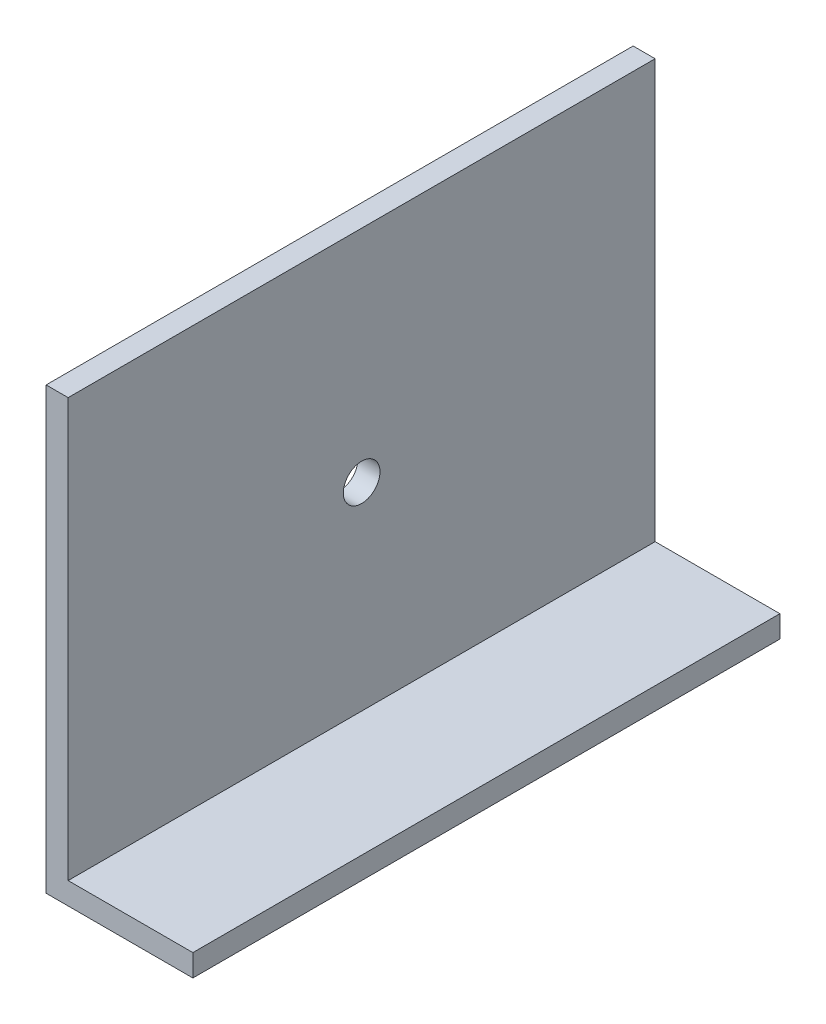
ISO-10303-21;
HEADER;
FILE_DESCRIPTION(('STEP AP214'),'2;1');
FILE_NAME('part.step','',(''),(''),'','','');
FILE_SCHEMA(('AUTOMOTIVE_DESIGN { 1 0 10303 214 1 1 1 1 }'));
ENDSEC;
DATA;
#1=APPLICATION_CONTEXT('core data for automotive mechanical design processes');
#2=APPLICATION_PROTOCOL_DEFINITION('international standard','automotive_design',2000,#1);
#3=PRODUCT_CONTEXT('',#1,'mechanical');
#4=PRODUCT('Part','Part','',(#3));
#5=PRODUCT_RELATED_PRODUCT_CATEGORY('part','',(#4));
#6=PRODUCT_DEFINITION_FORMATION('','',#4);
#7=PRODUCT_DEFINITION_CONTEXT('part definition',#1,'design');
#8=PRODUCT_DEFINITION('design','',#6,#7);
#9=PRODUCT_DEFINITION_SHAPE('','',#8);
#10=(LENGTH_UNIT() NAMED_UNIT(*) SI_UNIT(.MILLI.,.METRE.));
#11=(NAMED_UNIT(*) PLANE_ANGLE_UNIT() SI_UNIT($,.RADIAN.));
#12=(NAMED_UNIT(*) SI_UNIT($,.STERADIAN.) SOLID_ANGLE_UNIT());
#13=UNCERTAINTY_MEASURE_WITH_UNIT(LENGTH_MEASURE(1.E-05),#10,'distance_accuracy_value','');
#14=(GEOMETRIC_REPRESENTATION_CONTEXT(3) GLOBAL_UNCERTAINTY_ASSIGNED_CONTEXT((#13)) GLOBAL_UNIT_ASSIGNED_CONTEXT((#10,
#11,#12)) REPRESENTATION_CONTEXT('',''));
#15=CARTESIAN_POINT('',(0.,0.,0.));
#16=DIRECTION('',(0.,0.,1.));
#17=DIRECTION('',(1.,0.,0.));
#18=AXIS2_PLACEMENT_3D('',#15,#16,#17);
#19=CARTESIAN_POINT('',(0.,0.,80.));
#20=DIRECTION('',(1.,0.,0.));
#21=DIRECTION('',(0.,0.,-1.));
#22=AXIS2_PLACEMENT_3D('',#19,#20,#21);
#23=PLANE('',#22);
#24=CARTESIAN_POINT('',(0.,30.,40.));
#25=DIRECTION('',(-1.,0.,0.));
#26=DIRECTION('',(0.,0.,1.));
#27=AXIS2_PLACEMENT_3D('',#24,#25,#26);
#28=CIRCLE('',#27,2.5);
#29=CARTESIAN_POINT('',(0.,30.,42.5));
#30=VERTEX_POINT('',#29);
#31=EDGE_CURVE('E161',#30,#30,#28,.T.);
#32=ORIENTED_EDGE('',*,*,#31,.F.);
#33=EDGE_LOOP('',(#32));
#34=FACE_BOUND('',#33,.T.);
#35=DIRECTION('',(0.,-1.,0.));
#36=VECTOR('',#35,1.);
#37=CARTESIAN_POINT('',(0.,0.,0.));
#38=LINE('',#37,#36);
#39=CARTESIAN_POINT('',(0.,60.,0.));
#40=VERTEX_POINT('',#39);
#41=CARTESIAN_POINT('',(0.,0.,0.));
#42=VERTEX_POINT('',#41);
#43=EDGE_CURVE('E118',#40,#42,#38,.T.);
#44=ORIENTED_EDGE('',*,*,#43,.T.);
#45=DIRECTION('',(0.,0.,-1.));
#46=VECTOR('',#45,1.);
#47=CARTESIAN_POINT('',(0.,0.,80.));
#48=LINE('',#47,#46);
#49=CARTESIAN_POINT('',(0.,0.,80.));
#50=VERTEX_POINT('',#49);
#51=EDGE_CURVE('E11',#50,#42,#48,.T.);
#52=ORIENTED_EDGE('',*,*,#51,.F.);
#53=DIRECTION('',(0.,-1.,0.));
#54=VECTOR('',#53,1.);
#55=CARTESIAN_POINT('',(0.,0.,80.));
#56=LINE('',#55,#54);
#57=CARTESIAN_POINT('',(0.,60.,80.));
#58=VERTEX_POINT('',#57);
#59=EDGE_CURVE('E128',#58,#50,#56,.T.);
#60=ORIENTED_EDGE('',*,*,#59,.F.);
#61=DIRECTION('',(0.,0.,-1.));
#62=VECTOR('',#61,1.);
#63=CARTESIAN_POINT('',(0.,60.,80.));
#64=LINE('',#63,#62);
#65=EDGE_CURVE('E114',#58,#40,#64,.T.);
#66=ORIENTED_EDGE('',*,*,#65,.T.);
#67=EDGE_LOOP('',(#44,#52,#60,#66));
#68=FACE_BOUND('',#67,.T.);
#69=ADVANCED_FACE('F33',(#34,#68),#23,.F.);
#70=CARTESIAN_POINT('',(0.,0.,80.));
#71=DIRECTION('',(0.,1.,0.));
#72=DIRECTION('',(0.,0.,1.));
#73=AXIS2_PLACEMENT_3D('',#70,#71,#72);
#74=PLANE('',#73);
#75=DIRECTION('',(1.,0.,0.));
#76=VECTOR('',#75,1.);
#77=CARTESIAN_POINT('',(0.,0.,0.));
#78=LINE('',#77,#76);
#79=CARTESIAN_POINT('',(20.,0.,0.));
#80=VERTEX_POINT('',#79);
#81=EDGE_CURVE('E121',#42,#80,#78,.T.);
#82=ORIENTED_EDGE('',*,*,#81,.T.);
#83=DIRECTION('',(0.,0.,-1.));
#84=VECTOR('',#83,1.);
#85=CARTESIAN_POINT('',(20.,0.,80.));
#86=LINE('',#85,#84);
#87=CARTESIAN_POINT('',(20.,0.,80.));
#88=VERTEX_POINT('',#87);
#89=EDGE_CURVE('E42',#88,#80,#86,.T.);
#90=ORIENTED_EDGE('',*,*,#89,.F.);
#91=DIRECTION('',(1.,0.,0.));
#92=VECTOR('',#91,1.);
#93=CARTESIAN_POINT('',(0.,0.,80.));
#94=LINE('',#93,#92);
#95=EDGE_CURVE('E87',#50,#88,#94,.T.);
#96=ORIENTED_EDGE('',*,*,#95,.F.);
#97=ORIENTED_EDGE('',*,*,#51,.T.);
#98=EDGE_LOOP('',(#82,#90,#96,#97));
#99=FACE_BOUND('',#98,.T.);
#100=ADVANCED_FACE('F154',(#99),#74,.F.);
#101=CARTESIAN_POINT('',(20.,0.,80.));
#102=DIRECTION('',(-1.,0.,0.));
#103=DIRECTION('',(0.,-1.,0.));
#104=AXIS2_PLACEMENT_3D('',#101,#102,#103);
#105=PLANE('',#104);
#106=DIRECTION('',(0.,1.,0.));
#107=VECTOR('',#106,1.);
#108=CARTESIAN_POINT('',(20.,0.,0.));
#109=LINE('',#108,#107);
#110=CARTESIAN_POINT('',(20.,3.,0.));
#111=VERTEX_POINT('',#110);
#112=EDGE_CURVE('E123',#80,#111,#109,.T.);
#113=ORIENTED_EDGE('',*,*,#112,.T.);
#114=DIRECTION('',(0.,0.,-1.));
#115=VECTOR('',#114,1.);
#116=CARTESIAN_POINT('',(20.,3.,80.));
#117=LINE('',#116,#115);
#118=CARTESIAN_POINT('',(20.,3.,80.));
#119=VERTEX_POINT('',#118);
#120=EDGE_CURVE('E109',#119,#111,#117,.T.);
#121=ORIENTED_EDGE('',*,*,#120,.F.);
#122=DIRECTION('',(0.,1.,0.));
#123=VECTOR('',#122,1.);
#124=CARTESIAN_POINT('',(20.,0.,80.));
#125=LINE('',#124,#123);
#126=EDGE_CURVE('E100',#88,#119,#125,.T.);
#127=ORIENTED_EDGE('',*,*,#126,.F.);
#128=ORIENTED_EDGE('',*,*,#89,.T.);
#129=EDGE_LOOP('',(#113,#121,#127,#128));
#130=FACE_BOUND('',#129,.T.);
#131=ADVANCED_FACE('F135',(#130),#105,.F.);
#132=CARTESIAN_POINT('',(20.,3.,80.));
#133=DIRECTION('',(0.,-1.,0.));
#134=DIRECTION('',(1.,0.,0.));
#135=AXIS2_PLACEMENT_3D('',#132,#133,#134);
#136=PLANE('',#135);
#137=DIRECTION('',(-1.,0.,0.));
#138=VECTOR('',#137,1.);
#139=CARTESIAN_POINT('',(20.,3.,0.));
#140=LINE('',#139,#138);
#141=CARTESIAN_POINT('',(3.00000000000001,3.,0.));
#142=VERTEX_POINT('',#141);
#143=EDGE_CURVE('E108',#111,#142,#140,.T.);
#144=ORIENTED_EDGE('',*,*,#143,.T.);
#145=DIRECTION('',(0.,0.,-1.));
#146=VECTOR('',#145,1.);
#147=CARTESIAN_POINT('',(3.00000000000001,3.,80.));
#148=LINE('',#147,#146);
#149=CARTESIAN_POINT('',(3.00000000000001,3.,80.));
#150=VERTEX_POINT('',#149);
#151=EDGE_CURVE('E105',#150,#142,#148,.T.);
#152=ORIENTED_EDGE('',*,*,#151,.F.);
#153=DIRECTION('',(-1.,0.,0.));
#154=VECTOR('',#153,1.);
#155=CARTESIAN_POINT('',(20.,3.,80.));
#156=LINE('',#155,#154);
#157=EDGE_CURVE('E94',#119,#150,#156,.T.);
#158=ORIENTED_EDGE('',*,*,#157,.F.);
#159=ORIENTED_EDGE('',*,*,#120,.T.);
#160=EDGE_LOOP('',(#144,#152,#158,#159));
#161=FACE_BOUND('',#160,.T.);
#162=ADVANCED_FACE('F106',(#161),#136,.F.);
#163=CARTESIAN_POINT('',(3.,60.,80.));
#164=DIRECTION('',(-1.,0.,0.));
#165=DIRECTION('',(0.,-1.,0.));
#166=AXIS2_PLACEMENT_3D('',#163,#164,#165);
#167=PLANE('',#166);
#168=CARTESIAN_POINT('',(3.,30.,40.));
#169=DIRECTION('',(-1.,0.,0.));
#170=DIRECTION('',(0.,-1.,0.));
#171=AXIS2_PLACEMENT_3D('',#168,#169,#170);
#172=CIRCLE('',#171,2.5);
#173=CARTESIAN_POINT('',(3.,27.5,40.));
#174=VERTEX_POINT('',#173);
#175=EDGE_CURVE('E36',#174,#174,#172,.T.);
#176=ORIENTED_EDGE('',*,*,#175,.T.);
#177=EDGE_LOOP('',(#176));
#178=FACE_BOUND('',#177,.T.);
#179=DIRECTION('',(0.,1.,0.));
#180=VECTOR('',#179,1.);
#181=CARTESIAN_POINT('',(3.,60.,0.));
#182=LINE('',#181,#180);
#183=CARTESIAN_POINT('',(3.,60.,0.));
#184=VERTEX_POINT('',#183);
#185=EDGE_CURVE('E73',#142,#184,#182,.T.);
#186=ORIENTED_EDGE('',*,*,#185,.T.);
#187=DIRECTION('',(0.,0.,-1.));
#188=VECTOR('',#187,1.);
#189=CARTESIAN_POINT('',(3.,60.,80.));
#190=LINE('',#189,#188);
#191=CARTESIAN_POINT('',(3.,60.,80.));
#192=VERTEX_POINT('',#191);
#193=EDGE_CURVE('E110',#192,#184,#190,.T.);
#194=ORIENTED_EDGE('',*,*,#193,.F.);
#195=DIRECTION('',(0.,1.,0.));
#196=VECTOR('',#195,1.);
#197=CARTESIAN_POINT('',(3.,60.,80.));
#198=LINE('',#197,#196);
#199=EDGE_CURVE('E98',#150,#192,#198,.T.);
#200=ORIENTED_EDGE('',*,*,#199,.F.);
#201=ORIENTED_EDGE('',*,*,#151,.T.);
#202=EDGE_LOOP('',(#186,#194,#200,#201));
#203=FACE_BOUND('',#202,.T.);
#204=ADVANCED_FACE('F112',(#178,#203),#167,.F.);
#205=CARTESIAN_POINT('',(0.,60.,80.));
#206=DIRECTION('',(0.,-1.,0.));
#207=DIRECTION('',(0.,0.,-1.));
#208=AXIS2_PLACEMENT_3D('',#205,#206,#207);
#209=PLANE('',#208);
#210=DIRECTION('',(-1.,0.,0.));
#211=VECTOR('',#210,1.);
#212=CARTESIAN_POINT('',(0.,60.,0.));
#213=LINE('',#212,#211);
#214=EDGE_CURVE('E79',#184,#40,#213,.T.);
#215=ORIENTED_EDGE('',*,*,#214,.T.);
#216=ORIENTED_EDGE('',*,*,#65,.F.);
#217=DIRECTION('',(-1.,0.,0.));
#218=VECTOR('',#217,1.);
#219=CARTESIAN_POINT('',(0.,60.,80.));
#220=LINE('',#219,#218);
#221=EDGE_CURVE('E50',#192,#58,#220,.T.);
#222=ORIENTED_EDGE('',*,*,#221,.F.);
#223=ORIENTED_EDGE('',*,*,#193,.T.);
#224=EDGE_LOOP('',(#215,#216,#222,#223));
#225=FACE_BOUND('',#224,.T.);
#226=ADVANCED_FACE('F142',(#225),#209,.F.);
#227=CARTESIAN_POINT('',(0.,0.,80.));
#228=DIRECTION('',(0.,0.,-1.));
#229=DIRECTION('',(-1.,0.,0.));
#230=AXIS2_PLACEMENT_3D('',#227,#228,#229);
#231=PLANE('',#230);
#232=ORIENTED_EDGE('',*,*,#59,.T.);
#233=ORIENTED_EDGE('',*,*,#95,.T.);
#234=ORIENTED_EDGE('',*,*,#126,.T.);
#235=ORIENTED_EDGE('',*,*,#157,.T.);
#236=ORIENTED_EDGE('',*,*,#199,.T.);
#237=ORIENTED_EDGE('',*,*,#221,.T.);
#238=EDGE_LOOP('',(#232,#233,#234,#235,#236,#237));
#239=FACE_BOUND('',#238,.T.);
#240=ADVANCED_FACE('F96',(#239),#231,.F.);
#241=CARTESIAN_POINT('',(0.,0.,0.));
#242=DIRECTION('',(0.,0.,-1.));
#243=DIRECTION('',(-1.,0.,0.));
#244=AXIS2_PLACEMENT_3D('',#241,#242,#243);
#245=PLANE('',#244);
#246=ORIENTED_EDGE('',*,*,#43,.F.);
#247=ORIENTED_EDGE('',*,*,#214,.F.);
#248=ORIENTED_EDGE('',*,*,#185,.F.);
#249=ORIENTED_EDGE('',*,*,#143,.F.);
#250=ORIENTED_EDGE('',*,*,#112,.F.);
#251=ORIENTED_EDGE('',*,*,#81,.F.);
#252=EDGE_LOOP('',(#246,#247,#248,#249,#250,#251));
#253=FACE_BOUND('',#252,.T.);
#254=ADVANCED_FACE('F138',(#253),#245,.T.);
#255=CARTESIAN_POINT('',(20.,30.,40.));
#256=DIRECTION('',(-1.,0.,0.));
#257=DIRECTION('',(0.,0.,1.));
#258=AXIS2_PLACEMENT_3D('',#255,#256,#257);
#259=CYLINDRICAL_SURFACE('',#258,2.5);
#260=ORIENTED_EDGE('',*,*,#31,.T.);
#261=EDGE_LOOP('',(#260));
#262=FACE_BOUND('',#261,.T.);
#263=ORIENTED_EDGE('',*,*,#175,.F.);
#264=EDGE_LOOP('',(#263));
#265=FACE_BOUND('',#264,.T.);
#266=ADVANCED_FACE('F169',(#262,#265),#259,.F.);
#267=CLOSED_SHELL('',(#69,#100,#131,#162,#204,#226,#240,#254,#266));
#268=MANIFOLD_SOLID_BREP('B2',#267);
#269=ADVANCED_BREP_SHAPE_REPRESENTATION('',(#18,#268),#14);
#270=SHAPE_DEFINITION_REPRESENTATION(#9,#269);
ENDSEC;
END-ISO-10303-21;
